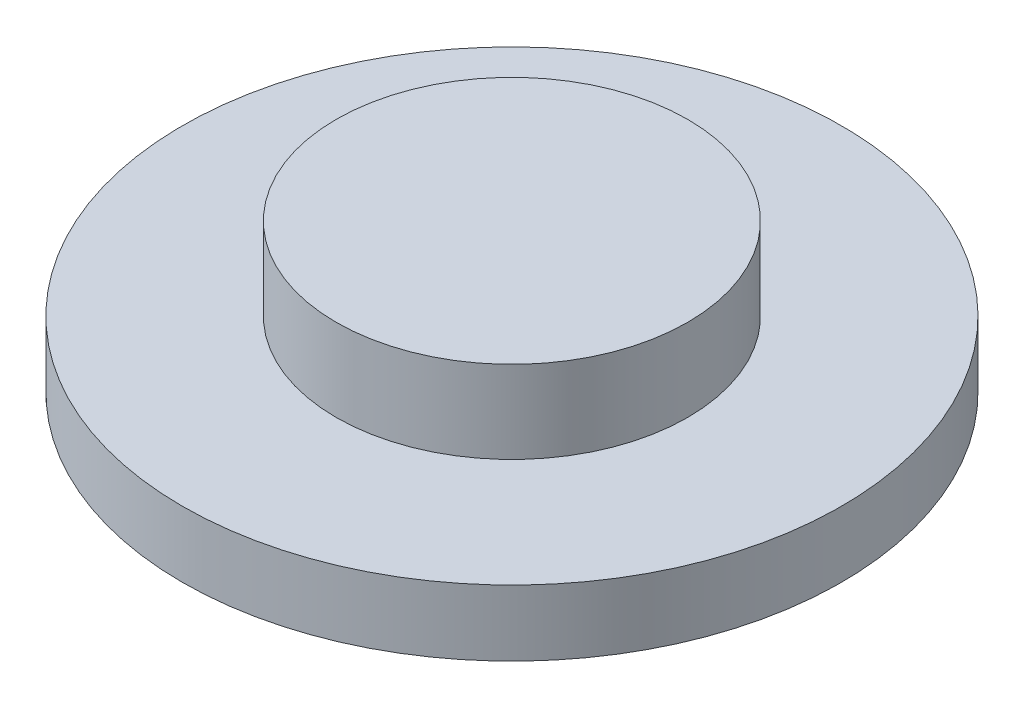
ISO-10303-21;
HEADER;
FILE_DESCRIPTION(('STEP AP214'),'2;1');
FILE_NAME('part.step','',(''),(''),'','','');
FILE_SCHEMA(('AUTOMOTIVE_DESIGN { 1 0 10303 214 1 1 1 1 }'));
ENDSEC;
DATA;
#1=APPLICATION_CONTEXT('core data for automotive mechanical design processes');
#2=APPLICATION_PROTOCOL_DEFINITION('international standard','automotive_design',2000,#1);
#3=PRODUCT_CONTEXT('',#1,'mechanical');
#4=PRODUCT('Part','Part','',(#3));
#5=PRODUCT_RELATED_PRODUCT_CATEGORY('part','',(#4));
#6=PRODUCT_DEFINITION_FORMATION('','',#4);
#7=PRODUCT_DEFINITION_CONTEXT('part definition',#1,'design');
#8=PRODUCT_DEFINITION('design','',#6,#7);
#9=PRODUCT_DEFINITION_SHAPE('','',#8);
#10=(LENGTH_UNIT() NAMED_UNIT(*) SI_UNIT(.MILLI.,.METRE.));
#11=(NAMED_UNIT(*) PLANE_ANGLE_UNIT() SI_UNIT($,.RADIAN.));
#12=(NAMED_UNIT(*) SI_UNIT($,.STERADIAN.) SOLID_ANGLE_UNIT());
#13=UNCERTAINTY_MEASURE_WITH_UNIT(LENGTH_MEASURE(1.E-05),#10,'distance_accuracy_value','');
#14=(GEOMETRIC_REPRESENTATION_CONTEXT(3) GLOBAL_UNCERTAINTY_ASSIGNED_CONTEXT((#13)) GLOBAL_UNIT_ASSIGNED_CONTEXT((#10,
#11,#12)) REPRESENTATION_CONTEXT('',''));
#15=CARTESIAN_POINT('',(0.,0.,0.));
#16=DIRECTION('',(0.,0.,1.));
#17=DIRECTION('',(1.,0.,0.));
#18=AXIS2_PLACEMENT_3D('',#15,#16,#17);
#19=CARTESIAN_POINT('',(0.,3.,0.));
#20=DIRECTION('',(0.,-1.,0.));
#21=DIRECTION('',(0.,0.,-1.));
#22=AXIS2_PLACEMENT_3D('',#19,#20,#21);
#23=CYLINDRICAL_SURFACE('',#22,15.);
#24=CARTESIAN_POINT('',(0.,3.,0.));
#25=DIRECTION('',(0.,1.,0.));
#26=DIRECTION('',(0.,0.,1.));
#27=AXIS2_PLACEMENT_3D('',#24,#25,#26);
#28=CIRCLE('',#27,15.);
#29=CARTESIAN_POINT('',(0.,3.,15.));
#30=VERTEX_POINT('',#29);
#31=EDGE_CURVE('E46',#30,#30,#28,.T.);
#32=ORIENTED_EDGE('',*,*,#31,.F.);
#33=EDGE_LOOP('',(#32));
#34=FACE_BOUND('',#33,.T.);
#35=CARTESIAN_POINT('',(0.,0.,0.));
#36=DIRECTION('',(0.,1.,0.));
#37=DIRECTION('',(0.,0.,1.));
#38=AXIS2_PLACEMENT_3D('',#35,#36,#37);
#39=CIRCLE('',#38,15.);
#40=CARTESIAN_POINT('',(0.,0.,15.));
#41=VERTEX_POINT('',#40);
#42=EDGE_CURVE('E42',#41,#41,#39,.T.);
#43=ORIENTED_EDGE('',*,*,#42,.T.);
#44=EDGE_LOOP('',(#43));
#45=FACE_BOUND('',#44,.T.);
#46=ADVANCED_FACE('F39',(#34,#45),#23,.T.);
#47=CARTESIAN_POINT('',(0.,3.,0.));
#48=DIRECTION('',(0.,1.,0.));
#49=DIRECTION('',(0.,0.,1.));
#50=AXIS2_PLACEMENT_3D('',#47,#48,#49);
#51=PLANE('',#50);
#52=CARTESIAN_POINT('',(0.,3.,0.));
#53=DIRECTION('',(0.,1.,0.));
#54=DIRECTION('',(0.,0.,1.));
#55=AXIS2_PLACEMENT_3D('',#52,#53,#54);
#56=CIRCLE('',#55,8.);
#57=CARTESIAN_POINT('',(0.,3.,8.));
#58=VERTEX_POINT('',#57);
#59=EDGE_CURVE('E10',#58,#58,#56,.T.);
#60=ORIENTED_EDGE('',*,*,#59,.F.);
#61=EDGE_LOOP('',(#60));
#62=FACE_BOUND('',#61,.T.);
#63=ORIENTED_EDGE('',*,*,#31,.T.);
#64=EDGE_LOOP('',(#63));
#65=FACE_BOUND('',#64,.T.);
#66=ADVANCED_FACE('F63',(#62,#65),#51,.T.);
#67=CARTESIAN_POINT('',(0.,0.,0.));
#68=DIRECTION('',(0.,1.,0.));
#69=DIRECTION('',(0.,0.,1.));
#70=AXIS2_PLACEMENT_3D('',#67,#68,#69);
#71=PLANE('',#70);
#72=ORIENTED_EDGE('',*,*,#42,.F.);
#73=EDGE_LOOP('',(#72));
#74=FACE_BOUND('',#73,.T.);
#75=ADVANCED_FACE('F60',(#74),#71,.F.);
#76=CARTESIAN_POINT('',(0.,6.75,0.));
#77=DIRECTION('',(0.,-1.,0.));
#78=DIRECTION('',(0.,0.,-1.));
#79=AXIS2_PLACEMENT_3D('',#76,#77,#78);
#80=CYLINDRICAL_SURFACE('',#79,8.);
#81=CARTESIAN_POINT('',(0.,6.75,0.));
#82=DIRECTION('',(0.,1.,0.));
#83=DIRECTION('',(0.,0.,1.));
#84=AXIS2_PLACEMENT_3D('',#81,#82,#83);
#85=CIRCLE('',#84,8.);
#86=CARTESIAN_POINT('',(0.,6.75,8.));
#87=VERTEX_POINT('',#86);
#88=EDGE_CURVE('E52',#87,#87,#85,.T.);
#89=ORIENTED_EDGE('',*,*,#88,.F.);
#90=EDGE_LOOP('',(#89));
#91=FACE_BOUND('',#90,.T.);
#92=ORIENTED_EDGE('',*,*,#59,.T.);
#93=EDGE_LOOP('',(#92));
#94=FACE_BOUND('',#93,.T.);
#95=ADVANCED_FACE('F62',(#91,#94),#80,.T.);
#96=CARTESIAN_POINT('',(0.,6.75,0.));
#97=DIRECTION('',(0.,1.,0.));
#98=DIRECTION('',(0.,0.,1.));
#99=AXIS2_PLACEMENT_3D('',#96,#97,#98);
#100=PLANE('',#99);
#101=ORIENTED_EDGE('',*,*,#88,.T.);
#102=EDGE_LOOP('',(#101));
#103=FACE_BOUND('',#102,.T.);
#104=ADVANCED_FACE('F69',(#103),#100,.T.);
#105=CLOSED_SHELL('',(#46,#66,#75,#95,#104));
#106=MANIFOLD_SOLID_BREP('B2',#105);
#107=ADVANCED_BREP_SHAPE_REPRESENTATION('',(#18,#106),#14);
#108=SHAPE_DEFINITION_REPRESENTATION(#9,#107);
ENDSEC;
END-ISO-10303-21;
